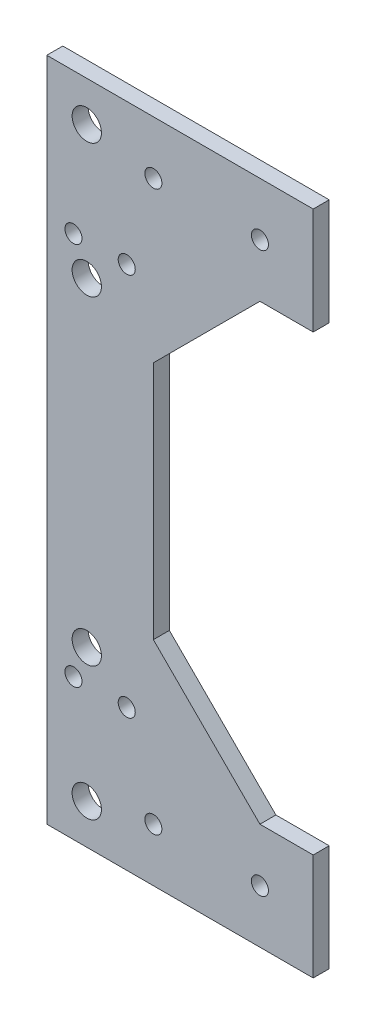
ISO-10303-21;
HEADER;
FILE_DESCRIPTION(('STEP AP214'),'2;1');
FILE_NAME('part.step','',(''),(''),'','','');
FILE_SCHEMA(('AUTOMOTIVE_DESIGN { 1 0 10303 214 1 1 1 1 }'));
ENDSEC;
DATA;
#1=APPLICATION_CONTEXT('core data for automotive mechanical design processes');
#2=APPLICATION_PROTOCOL_DEFINITION('international standard','automotive_design',2000,#1);
#3=PRODUCT_CONTEXT('',#1,'mechanical');
#4=PRODUCT('Part','Part','',(#3));
#5=PRODUCT_RELATED_PRODUCT_CATEGORY('part','',(#4));
#6=PRODUCT_DEFINITION_FORMATION('','',#4);
#7=PRODUCT_DEFINITION_CONTEXT('part definition',#1,'design');
#8=PRODUCT_DEFINITION('design','',#6,#7);
#9=PRODUCT_DEFINITION_SHAPE('','',#8);
#10=(LENGTH_UNIT() NAMED_UNIT(*) SI_UNIT(.MILLI.,.METRE.));
#11=(NAMED_UNIT(*) PLANE_ANGLE_UNIT() SI_UNIT($,.RADIAN.));
#12=(NAMED_UNIT(*) SI_UNIT($,.STERADIAN.) SOLID_ANGLE_UNIT());
#13=UNCERTAINTY_MEASURE_WITH_UNIT(LENGTH_MEASURE(1.E-05),#10,'distance_accuracy_value','');
#14=(GEOMETRIC_REPRESENTATION_CONTEXT(3) GLOBAL_UNCERTAINTY_ASSIGNED_CONTEXT((#13)) GLOBAL_UNIT_ASSIGNED_CONTEXT((#10,
#11,#12)) REPRESENTATION_CONTEXT('',''));
#15=CARTESIAN_POINT('',(0.,0.,0.));
#16=DIRECTION('',(0.,0.,1.));
#17=DIRECTION('',(1.,0.,0.));
#18=AXIS2_PLACEMENT_3D('',#15,#16,#17);
#19=CARTESIAN_POINT('',(0.,0.,3.));
#20=DIRECTION('',(0.,0.,1.));
#21=DIRECTION('',(1.,0.,0.));
#22=AXIS2_PLACEMENT_3D('',#19,#20,#21);
#23=PLANE('',#22);
#24=CARTESIAN_POINT('',(-87.4999999999999,55.,3.));
#25=DIRECTION('',(0.,0.,1.));
#26=DIRECTION('',(1.,0.,0.));
#27=AXIS2_PLACEMENT_3D('',#24,#25,#26);
#28=CIRCLE('',#27,2.75000000000001);
#29=CARTESIAN_POINT('',(-84.7499999999999,55.,3.));
#30=VERTEX_POINT('',#29);
#31=EDGE_CURVE('E490',#30,#30,#28,.T.);
#32=ORIENTED_EDGE('',*,*,#31,.F.);
#33=EDGE_LOOP('',(#32));
#34=FACE_BOUND('',#33,.T.);
#35=CARTESIAN_POINT('',(-87.5,30.,3.));
#36=DIRECTION('',(0.,0.,1.));
#37=DIRECTION('',(1.,0.,0.));
#38=AXIS2_PLACEMENT_3D('',#35,#36,#37);
#39=CIRCLE('',#38,2.75000000000001);
#40=CARTESIAN_POINT('',(-84.75,30.,3.));
#41=VERTEX_POINT('',#40);
#42=EDGE_CURVE('E511',#41,#41,#39,.T.);
#43=ORIENTED_EDGE('',*,*,#42,.F.);
#44=EDGE_LOOP('',(#43));
#45=FACE_BOUND('',#44,.T.);
#46=CARTESIAN_POINT('',(-87.4999999999999,-30.,3.));
#47=DIRECTION('',(0.,0.,1.));
#48=DIRECTION('',(1.,0.,0.));
#49=AXIS2_PLACEMENT_3D('',#46,#47,#48);
#50=CIRCLE('',#49,2.74999999999999);
#51=CARTESIAN_POINT('',(-84.75,-30.,3.));
#52=VERTEX_POINT('',#51);
#53=EDGE_CURVE('E498',#52,#52,#50,.T.);
#54=ORIENTED_EDGE('',*,*,#53,.F.);
#55=EDGE_LOOP('',(#54));
#56=FACE_BOUND('',#55,.T.);
#57=CARTESIAN_POINT('',(-87.5,-55.,3.));
#58=DIRECTION('',(0.,0.,1.));
#59=DIRECTION('',(1.,0.,0.));
#60=AXIS2_PLACEMENT_3D('',#57,#58,#59);
#61=CIRCLE('',#60,2.75000000000001);
#62=CARTESIAN_POINT('',(-84.75,-55.,3.));
#63=VERTEX_POINT('',#62);
#64=EDGE_CURVE('E494',#63,#63,#61,.T.);
#65=ORIENTED_EDGE('',*,*,#64,.F.);
#66=EDGE_LOOP('',(#65));
#67=FACE_BOUND('',#66,.T.);
#68=CARTESIAN_POINT('',(-90.0000000000001,36.0000000000002,3.));
#69=DIRECTION('',(0.,0.,1.));
#70=DIRECTION('',(1.,0.,0.));
#71=AXIS2_PLACEMENT_3D('',#68,#69,#70);
#72=CIRCLE('',#71,1.59999999999985);
#73=CARTESIAN_POINT('',(-88.4000000000003,36.0000000000002,3.));
#74=VERTEX_POINT('',#73);
#75=EDGE_CURVE('E519',#74,#74,#72,.T.);
#76=ORIENTED_EDGE('',*,*,#75,.F.);
#77=EDGE_LOOP('',(#76));
#78=FACE_BOUND('',#77,.T.);
#79=CARTESIAN_POINT('',(-79.9999999999998,-35.9999999999999,3.));
#80=DIRECTION('',(0.,0.,1.));
#81=DIRECTION('',(1.,0.,0.));
#82=AXIS2_PLACEMENT_3D('',#79,#80,#81);
#83=CIRCLE('',#82,1.59999999999985);
#84=CARTESIAN_POINT('',(-78.4,-35.9999999999999,3.));
#85=VERTEX_POINT('',#84);
#86=EDGE_CURVE('E518',#85,#85,#83,.T.);
#87=ORIENTED_EDGE('',*,*,#86,.F.);
#88=EDGE_LOOP('',(#87));
#89=FACE_BOUND('',#88,.T.);
#90=CARTESIAN_POINT('',(-90.0000000000001,-35.9999999999999,3.));
#91=DIRECTION('',(0.,0.,1.));
#92=DIRECTION('',(1.,0.,0.));
#93=AXIS2_PLACEMENT_3D('',#90,#91,#92);
#94=CIRCLE('',#93,1.59999999999985);
#95=CARTESIAN_POINT('',(-88.4000000000003,-35.9999999999999,3.));
#96=VERTEX_POINT('',#95);
#97=EDGE_CURVE('E515',#96,#96,#94,.T.);
#98=ORIENTED_EDGE('',*,*,#97,.F.);
#99=EDGE_LOOP('',(#98));
#100=FACE_BOUND('',#99,.T.);
#101=CARTESIAN_POINT('',(-79.9999999999999,36.0000000000002,3.));
#102=DIRECTION('',(0.,0.,1.));
#103=DIRECTION('',(1.,0.,0.));
#104=AXIS2_PLACEMENT_3D('',#101,#102,#103);
#105=CIRCLE('',#104,1.59999999999985);
#106=CARTESIAN_POINT('',(-78.4,36.0000000000002,3.));
#107=VERTEX_POINT('',#106);
#108=EDGE_CURVE('E190',#107,#107,#105,.T.);
#109=ORIENTED_EDGE('',*,*,#108,.F.);
#110=EDGE_LOOP('',(#109));
#111=FACE_BOUND('',#110,.T.);
#112=CARTESIAN_POINT('',(-54.9999999999996,52.5,3.));
#113=DIRECTION('',(0.,0.,1.));
#114=DIRECTION('',(1.,0.,0.));
#115=AXIS2_PLACEMENT_3D('',#112,#113,#114);
#116=CIRCLE('',#115,1.60000000000002);
#117=CARTESIAN_POINT('',(-53.3999999999996,52.5,3.));
#118=VERTEX_POINT('',#117);
#119=EDGE_CURVE('E210',#118,#118,#116,.T.);
#120=ORIENTED_EDGE('',*,*,#119,.F.);
#121=EDGE_LOOP('',(#120));
#122=FACE_BOUND('',#121,.T.);
#123=CARTESIAN_POINT('',(-54.9999999999996,-52.5,3.));
#124=DIRECTION('',(0.,0.,1.));
#125=DIRECTION('',(1.,0.,0.));
#126=AXIS2_PLACEMENT_3D('',#123,#124,#125);
#127=CIRCLE('',#126,1.60000000000002);
#128=CARTESIAN_POINT('',(-53.3999999999996,-52.5,3.));
#129=VERTEX_POINT('',#128);
#130=EDGE_CURVE('E154',#129,#129,#127,.T.);
#131=ORIENTED_EDGE('',*,*,#130,.F.);
#132=EDGE_LOOP('',(#131));
#133=FACE_BOUND('',#132,.T.);
#134=DIRECTION('',(-1.,0.,0.));
#135=VECTOR('',#134,1.);
#136=CARTESIAN_POINT('',(-55.,62.5,3.));
#137=LINE('',#136,#135);
#138=CARTESIAN_POINT('',(-45.,62.5,3.));
#139=VERTEX_POINT('',#138);
#140=CARTESIAN_POINT('',(-95.,62.5,3.));
#141=VERTEX_POINT('',#140);
#142=EDGE_CURVE('E54',#139,#141,#137,.T.);
#143=ORIENTED_EDGE('',*,*,#142,.T.);
#144=DIRECTION('',(0.,-1.,0.));
#145=VECTOR('',#144,1.);
#146=CARTESIAN_POINT('',(-95.,62.5,3.));
#147=LINE('',#146,#145);
#148=CARTESIAN_POINT('',(-95.,-62.5,3.));
#149=VERTEX_POINT('',#148);
#150=EDGE_CURVE('E104',#141,#149,#147,.T.);
#151=ORIENTED_EDGE('',*,*,#150,.T.);
#152=DIRECTION('',(1.,0.,0.));
#153=VECTOR('',#152,1.);
#154=CARTESIAN_POINT('',(-55.,-62.5,3.));
#155=LINE('',#154,#153);
#156=CARTESIAN_POINT('',(-45.,-62.5,3.));
#157=VERTEX_POINT('',#156);
#158=EDGE_CURVE('E228',#149,#157,#155,.T.);
#159=ORIENTED_EDGE('',*,*,#158,.T.);
#160=DIRECTION('',(0.,1.,0.));
#161=VECTOR('',#160,1.);
#162=CARTESIAN_POINT('',(-45.,-42.5,3.));
#163=LINE('',#162,#161);
#164=CARTESIAN_POINT('',(-45.,-42.5,3.));
#165=VERTEX_POINT('',#164);
#166=EDGE_CURVE('E230',#157,#165,#163,.T.);
#167=ORIENTED_EDGE('',*,*,#166,.T.);
#168=DIRECTION('',(-1.,0.,0.));
#169=VECTOR('',#168,1.);
#170=CARTESIAN_POINT('',(-55.,-42.5,3.));
#171=LINE('',#170,#169);
#172=CARTESIAN_POINT('',(-55.,-42.5,3.));
#173=VERTEX_POINT('',#172);
#174=EDGE_CURVE('E232',#165,#173,#171,.T.);
#175=ORIENTED_EDGE('',*,*,#174,.T.);
#176=DIRECTION('',(-0.707106781186548,0.707106781186547,0.));
#177=VECTOR('',#176,1.);
#178=CARTESIAN_POINT('',(-55.,-42.5,3.));
#179=LINE('',#178,#177);
#180=CARTESIAN_POINT('',(-75.,-22.5,3.));
#181=VERTEX_POINT('',#180);
#182=EDGE_CURVE('E234',#173,#181,#179,.T.);
#183=ORIENTED_EDGE('',*,*,#182,.T.);
#184=DIRECTION('',(0.,1.,0.));
#185=VECTOR('',#184,1.);
#186=CARTESIAN_POINT('',(-75.,-22.5,3.));
#187=LINE('',#186,#185);
#188=CARTESIAN_POINT('',(-75.,22.5,3.));
#189=VERTEX_POINT('',#188);
#190=EDGE_CURVE('E130',#181,#189,#187,.T.);
#191=ORIENTED_EDGE('',*,*,#190,.T.);
#192=DIRECTION('',(0.707106781186548,0.707106781186547,0.));
#193=VECTOR('',#192,1.);
#194=CARTESIAN_POINT('',(-75.,22.5,3.));
#195=LINE('',#194,#193);
#196=CARTESIAN_POINT('',(-55.,42.5,3.));
#197=VERTEX_POINT('',#196);
#198=EDGE_CURVE('E124',#189,#197,#195,.T.);
#199=ORIENTED_EDGE('',*,*,#198,.T.);
#200=DIRECTION('',(1.,0.,0.));
#201=VECTOR('',#200,1.);
#202=CARTESIAN_POINT('',(-55.,42.5,3.));
#203=LINE('',#202,#201);
#204=CARTESIAN_POINT('',(-45.,42.5,3.));
#205=VERTEX_POINT('',#204);
#206=EDGE_CURVE('E128',#197,#205,#203,.T.);
#207=ORIENTED_EDGE('',*,*,#206,.T.);
#208=DIRECTION('',(0.,1.,0.));
#209=VECTOR('',#208,1.);
#210=CARTESIAN_POINT('',(-45.,62.5,3.));
#211=LINE('',#210,#209);
#212=EDGE_CURVE('E144',#205,#139,#211,.T.);
#213=ORIENTED_EDGE('',*,*,#212,.T.);
#214=EDGE_LOOP('',(#143,#151,#159,#167,#175,#183,#191,#199,#207,#213));
#215=FACE_BOUND('',#214,.T.);
#216=CARTESIAN_POINT('',(-74.9999999999996,-52.5,3.));
#217=DIRECTION('',(0.,0.,1.));
#218=DIRECTION('',(1.,0.,0.));
#219=AXIS2_PLACEMENT_3D('',#216,#217,#218);
#220=CIRCLE('',#219,1.60000000000002);
#221=CARTESIAN_POINT('',(-73.3999999999996,-52.5,3.));
#222=VERTEX_POINT('',#221);
#223=EDGE_CURVE('E216',#222,#222,#220,.T.);
#224=ORIENTED_EDGE('',*,*,#223,.F.);
#225=EDGE_LOOP('',(#224));
#226=FACE_BOUND('',#225,.T.);
#227=CARTESIAN_POINT('',(-74.9999999999996,52.5,3.));
#228=DIRECTION('',(0.,0.,1.));
#229=DIRECTION('',(1.,0.,0.));
#230=AXIS2_PLACEMENT_3D('',#227,#228,#229);
#231=CIRCLE('',#230,1.60000000000002);
#232=CARTESIAN_POINT('',(-73.3999999999996,52.5,3.));
#233=VERTEX_POINT('',#232);
#234=EDGE_CURVE('E201',#233,#233,#231,.T.);
#235=ORIENTED_EDGE('',*,*,#234,.F.);
#236=EDGE_LOOP('',(#235));
#237=FACE_BOUND('',#236,.T.);
#238=ADVANCED_FACE('F35',(#34,#45,#56,#67,#78,#89,#100,#111,#122,#133,#215,#226,#237),#23,.T.);
#239=CARTESIAN_POINT('',(0.,0.,0.));
#240=DIRECTION('',(0.,0.,1.));
#241=DIRECTION('',(1.,0.,0.));
#242=AXIS2_PLACEMENT_3D('',#239,#240,#241);
#243=PLANE('',#242);
#244=CARTESIAN_POINT('',(-87.4999999999999,55.,0.));
#245=DIRECTION('',(0.,0.,-1.));
#246=DIRECTION('',(-1.,0.,0.));
#247=AXIS2_PLACEMENT_3D('',#244,#245,#246);
#248=CIRCLE('',#247,2.75000000000001);
#249=CARTESIAN_POINT('',(-90.2499999999999,55.,0.));
#250=VERTEX_POINT('',#249);
#251=EDGE_CURVE('E493',#250,#250,#248,.T.);
#252=ORIENTED_EDGE('',*,*,#251,.F.);
#253=EDGE_LOOP('',(#252));
#254=FACE_BOUND('',#253,.T.);
#255=CARTESIAN_POINT('',(-87.5,30.,0.));
#256=DIRECTION('',(0.,0.,-1.));
#257=DIRECTION('',(-1.,0.,0.));
#258=AXIS2_PLACEMENT_3D('',#255,#256,#257);
#259=CIRCLE('',#258,2.75000000000001);
#260=CARTESIAN_POINT('',(-90.25,30.,0.));
#261=VERTEX_POINT('',#260);
#262=EDGE_CURVE('E495',#261,#261,#259,.T.);
#263=ORIENTED_EDGE('',*,*,#262,.F.);
#264=EDGE_LOOP('',(#263));
#265=FACE_BOUND('',#264,.T.);
#266=CARTESIAN_POINT('',(-87.4999999999999,-30.,0.));
#267=DIRECTION('',(0.,0.,-1.));
#268=DIRECTION('',(-1.,0.,0.));
#269=AXIS2_PLACEMENT_3D('',#266,#267,#268);
#270=CIRCLE('',#269,2.74999999999999);
#271=CARTESIAN_POINT('',(-90.2499999999999,-30.,0.));
#272=VERTEX_POINT('',#271);
#273=EDGE_CURVE('E501',#272,#272,#270,.T.);
#274=ORIENTED_EDGE('',*,*,#273,.F.);
#275=EDGE_LOOP('',(#274));
#276=FACE_BOUND('',#275,.T.);
#277=CARTESIAN_POINT('',(-87.5,-55.,0.));
#278=DIRECTION('',(0.,0.,-1.));
#279=DIRECTION('',(-1.,0.,0.));
#280=AXIS2_PLACEMENT_3D('',#277,#278,#279);
#281=CIRCLE('',#280,2.75000000000001);
#282=CARTESIAN_POINT('',(-90.25,-55.,0.));
#283=VERTEX_POINT('',#282);
#284=EDGE_CURVE('E506',#283,#283,#281,.T.);
#285=ORIENTED_EDGE('',*,*,#284,.F.);
#286=EDGE_LOOP('',(#285));
#287=FACE_BOUND('',#286,.T.);
#288=CARTESIAN_POINT('',(-90.0000000000001,36.0000000000002,0.));
#289=DIRECTION('',(0.,0.,1.));
#290=DIRECTION('',(1.,0.,0.));
#291=AXIS2_PLACEMENT_3D('',#288,#289,#290);
#292=CIRCLE('',#291,1.59999999999985);
#293=CARTESIAN_POINT('',(-88.4000000000003,36.0000000000002,0.));
#294=VERTEX_POINT('',#293);
#295=EDGE_CURVE('E39',#294,#294,#292,.T.);
#296=ORIENTED_EDGE('',*,*,#295,.T.);
#297=EDGE_LOOP('',(#296));
#298=FACE_BOUND('',#297,.T.);
#299=CARTESIAN_POINT('',(-79.9999999999998,-35.9999999999999,0.));
#300=DIRECTION('',(0.,0.,1.));
#301=DIRECTION('',(1.,0.,0.));
#302=AXIS2_PLACEMENT_3D('',#299,#300,#301);
#303=CIRCLE('',#302,1.59999999999985);
#304=CARTESIAN_POINT('',(-78.4,-35.9999999999999,0.));
#305=VERTEX_POINT('',#304);
#306=EDGE_CURVE('E192',#305,#305,#303,.T.);
#307=ORIENTED_EDGE('',*,*,#306,.T.);
#308=EDGE_LOOP('',(#307));
#309=FACE_BOUND('',#308,.T.);
#310=CARTESIAN_POINT('',(-90.0000000000001,-35.9999999999999,0.));
#311=DIRECTION('',(0.,0.,1.));
#312=DIRECTION('',(1.,0.,0.));
#313=AXIS2_PLACEMENT_3D('',#310,#311,#312);
#314=CIRCLE('',#313,1.59999999999985);
#315=CARTESIAN_POINT('',(-88.4000000000003,-35.9999999999999,0.));
#316=VERTEX_POINT('',#315);
#317=EDGE_CURVE('E189',#316,#316,#314,.T.);
#318=ORIENTED_EDGE('',*,*,#317,.T.);
#319=EDGE_LOOP('',(#318));
#320=FACE_BOUND('',#319,.T.);
#321=CARTESIAN_POINT('',(-79.9999999999999,36.0000000000002,0.));
#322=DIRECTION('',(0.,0.,1.));
#323=DIRECTION('',(1.,0.,0.));
#324=AXIS2_PLACEMENT_3D('',#321,#322,#323);
#325=CIRCLE('',#324,1.59999999999985);
#326=CARTESIAN_POINT('',(-78.4,36.0000000000002,0.));
#327=VERTEX_POINT('',#326);
#328=EDGE_CURVE('E186',#327,#327,#325,.T.);
#329=ORIENTED_EDGE('',*,*,#328,.T.);
#330=EDGE_LOOP('',(#329));
#331=FACE_BOUND('',#330,.T.);
#332=DIRECTION('',(0.,-1.,0.));
#333=VECTOR('',#332,1.);
#334=CARTESIAN_POINT('',(-95.,62.5,0.));
#335=LINE('',#334,#333);
#336=CARTESIAN_POINT('',(-95.,62.5,0.));
#337=VERTEX_POINT('',#336);
#338=CARTESIAN_POINT('',(-95.,-62.5,0.));
#339=VERTEX_POINT('',#338);
#340=EDGE_CURVE('E150',#337,#339,#335,.T.);
#341=ORIENTED_EDGE('',*,*,#340,.F.);
#342=DIRECTION('',(-1.,0.,0.));
#343=VECTOR('',#342,1.);
#344=CARTESIAN_POINT('',(-55.,62.5,0.));
#345=LINE('',#344,#343);
#346=CARTESIAN_POINT('',(-45.,62.5,0.));
#347=VERTEX_POINT('',#346);
#348=EDGE_CURVE('E167',#347,#337,#345,.T.);
#349=ORIENTED_EDGE('',*,*,#348,.F.);
#350=DIRECTION('',(0.,1.,0.));
#351=VECTOR('',#350,1.);
#352=CARTESIAN_POINT('',(-45.,62.5,0.));
#353=LINE('',#352,#351);
#354=CARTESIAN_POINT('',(-45.,42.5,0.));
#355=VERTEX_POINT('',#354);
#356=EDGE_CURVE('E97',#355,#347,#353,.T.);
#357=ORIENTED_EDGE('',*,*,#356,.F.);
#358=DIRECTION('',(1.,0.,0.));
#359=VECTOR('',#358,1.);
#360=CARTESIAN_POINT('',(-55.,42.5,0.));
#361=LINE('',#360,#359);
#362=CARTESIAN_POINT('',(-55.,42.5,0.));
#363=VERTEX_POINT('',#362);
#364=EDGE_CURVE('E90',#363,#355,#361,.T.);
#365=ORIENTED_EDGE('',*,*,#364,.F.);
#366=DIRECTION('',(0.707106781186548,0.707106781186547,0.));
#367=VECTOR('',#366,1.);
#368=CARTESIAN_POINT('',(-75.,22.5,0.));
#369=LINE('',#368,#367);
#370=CARTESIAN_POINT('',(-75.,22.5,0.));
#371=VERTEX_POINT('',#370);
#372=EDGE_CURVE('E138',#371,#363,#369,.T.);
#373=ORIENTED_EDGE('',*,*,#372,.F.);
#374=DIRECTION('',(0.,1.,0.));
#375=VECTOR('',#374,1.);
#376=CARTESIAN_POINT('',(-75.,-22.5,0.));
#377=LINE('',#376,#375);
#378=CARTESIAN_POINT('',(-75.,-22.5,0.));
#379=VERTEX_POINT('',#378);
#380=EDGE_CURVE('E162',#379,#371,#377,.T.);
#381=ORIENTED_EDGE('',*,*,#380,.F.);
#382=DIRECTION('',(-0.707106781186548,0.707106781186547,0.));
#383=VECTOR('',#382,1.);
#384=CARTESIAN_POINT('',(-55.,-42.5,0.));
#385=LINE('',#384,#383);
#386=CARTESIAN_POINT('',(-55.,-42.5,0.));
#387=VERTEX_POINT('',#386);
#388=EDGE_CURVE('E160',#387,#379,#385,.T.);
#389=ORIENTED_EDGE('',*,*,#388,.F.);
#390=DIRECTION('',(-1.,0.,0.));
#391=VECTOR('',#390,1.);
#392=CARTESIAN_POINT('',(-55.,-42.5,0.));
#393=LINE('',#392,#391);
#394=CARTESIAN_POINT('',(-45.,-42.5,0.));
#395=VERTEX_POINT('',#394);
#396=EDGE_CURVE('E158',#395,#387,#393,.T.);
#397=ORIENTED_EDGE('',*,*,#396,.F.);
#398=DIRECTION('',(0.,1.,0.));
#399=VECTOR('',#398,1.);
#400=CARTESIAN_POINT('',(-45.,-42.5,0.));
#401=LINE('',#400,#399);
#402=CARTESIAN_POINT('',(-45.,-62.5,0.));
#403=VERTEX_POINT('',#402);
#404=EDGE_CURVE('E156',#403,#395,#401,.T.);
#405=ORIENTED_EDGE('',*,*,#404,.F.);
#406=DIRECTION('',(1.,0.,0.));
#407=VECTOR('',#406,1.);
#408=CARTESIAN_POINT('',(-55.,-62.5,0.));
#409=LINE('',#408,#407);
#410=EDGE_CURVE('E153',#339,#403,#409,.T.);
#411=ORIENTED_EDGE('',*,*,#410,.F.);
#412=EDGE_LOOP('',(#341,#349,#357,#365,#373,#381,#389,#397,#405,#411));
#413=FACE_BOUND('',#412,.T.);
#414=CARTESIAN_POINT('',(-54.9999999999996,-52.5,0.));
#415=DIRECTION('',(0.,0.,1.));
#416=DIRECTION('',(1.,0.,0.));
#417=AXIS2_PLACEMENT_3D('',#414,#415,#416);
#418=CIRCLE('',#417,1.60000000000002);
#419=CARTESIAN_POINT('',(-53.3999999999996,-52.5,0.));
#420=VERTEX_POINT('',#419);
#421=EDGE_CURVE('E219',#420,#420,#418,.T.);
#422=ORIENTED_EDGE('',*,*,#421,.T.);
#423=EDGE_LOOP('',(#422));
#424=FACE_BOUND('',#423,.T.);
#425=CARTESIAN_POINT('',(-74.9999999999996,-52.5,0.));
#426=DIRECTION('',(0.,0.,1.));
#427=DIRECTION('',(1.,0.,0.));
#428=AXIS2_PLACEMENT_3D('',#425,#426,#427);
#429=CIRCLE('',#428,1.60000000000002);
#430=CARTESIAN_POINT('',(-73.3999999999996,-52.5,0.));
#431=VERTEX_POINT('',#430);
#432=EDGE_CURVE('E213',#431,#431,#429,.T.);
#433=ORIENTED_EDGE('',*,*,#432,.T.);
#434=EDGE_LOOP('',(#433));
#435=FACE_BOUND('',#434,.T.);
#436=CARTESIAN_POINT('',(-54.9999999999996,52.5,0.));
#437=DIRECTION('',(0.,0.,1.));
#438=DIRECTION('',(1.,0.,0.));
#439=AXIS2_PLACEMENT_3D('',#436,#437,#438);
#440=CIRCLE('',#439,1.60000000000002);
#441=CARTESIAN_POINT('',(-53.3999999999996,52.5,0.));
#442=VERTEX_POINT('',#441);
#443=EDGE_CURVE('E206',#442,#442,#440,.T.);
#444=ORIENTED_EDGE('',*,*,#443,.T.);
#445=EDGE_LOOP('',(#444));
#446=FACE_BOUND('',#445,.T.);
#447=CARTESIAN_POINT('',(-74.9999999999996,52.5,0.));
#448=DIRECTION('',(0.,0.,1.));
#449=DIRECTION('',(1.,0.,0.));
#450=AXIS2_PLACEMENT_3D('',#447,#448,#449);
#451=CIRCLE('',#450,1.60000000000002);
#452=CARTESIAN_POINT('',(-73.3999999999996,52.5,0.));
#453=VERTEX_POINT('',#452);
#454=EDGE_CURVE('E197',#453,#453,#451,.T.);
#455=ORIENTED_EDGE('',*,*,#454,.T.);
#456=EDGE_LOOP('',(#455));
#457=FACE_BOUND('',#456,.T.);
#458=ADVANCED_FACE('F247',(#254,#265,#276,#287,#298,#309,#320,#331,#413,#424,#435,#446,#457),
#243,.F.);
#459=CARTESIAN_POINT('',(-95.,62.5,3.));
#460=DIRECTION('',(1.,0.,0.));
#461=DIRECTION('',(0.,1.,0.));
#462=AXIS2_PLACEMENT_3D('',#459,#460,#461);
#463=PLANE('',#462);
#464=ORIENTED_EDGE('',*,*,#340,.T.);
#465=DIRECTION('',(0.,0.,-1.));
#466=VECTOR('',#465,1.);
#467=CARTESIAN_POINT('',(-95.,-62.5,3.));
#468=LINE('',#467,#466);
#469=EDGE_CURVE('E45',#149,#339,#468,.T.);
#470=ORIENTED_EDGE('',*,*,#469,.F.);
#471=ORIENTED_EDGE('',*,*,#150,.F.);
#472=DIRECTION('',(0.,0.,-1.));
#473=VECTOR('',#472,1.);
#474=CARTESIAN_POINT('',(-95.,62.5,3.));
#475=LINE('',#474,#473);
#476=EDGE_CURVE('E11',#141,#337,#475,.T.);
#477=ORIENTED_EDGE('',*,*,#476,.T.);
#478=EDGE_LOOP('',(#464,#470,#471,#477));
#479=FACE_BOUND('',#478,.T.);
#480=ADVANCED_FACE('F37',(#479),#463,.F.);
#481=CARTESIAN_POINT('',(-55.,-62.5,3.));
#482=DIRECTION('',(0.,1.,0.));
#483=DIRECTION('',(-1.,0.,0.));
#484=AXIS2_PLACEMENT_3D('',#481,#482,#483);
#485=PLANE('',#484);
#486=ORIENTED_EDGE('',*,*,#410,.T.);
#487=DIRECTION('',(0.,0.,-1.));
#488=VECTOR('',#487,1.);
#489=CARTESIAN_POINT('',(-45.,-62.5,3.));
#490=LINE('',#489,#488);
#491=EDGE_CURVE('E181',#157,#403,#490,.T.);
#492=ORIENTED_EDGE('',*,*,#491,.F.);
#493=ORIENTED_EDGE('',*,*,#158,.F.);
#494=ORIENTED_EDGE('',*,*,#469,.T.);
#495=EDGE_LOOP('',(#486,#492,#493,#494));
#496=FACE_BOUND('',#495,.T.);
#497=ADVANCED_FACE('F255',(#496),#485,.F.);
#498=CARTESIAN_POINT('',(-45.,-42.5,3.));
#499=DIRECTION('',(-1.,0.,0.));
#500=DIRECTION('',(0.,-1.,0.));
#501=AXIS2_PLACEMENT_3D('',#498,#499,#500);
#502=PLANE('',#501);
#503=ORIENTED_EDGE('',*,*,#404,.T.);
#504=DIRECTION('',(0.,0.,-1.));
#505=VECTOR('',#504,1.);
#506=CARTESIAN_POINT('',(-45.,-42.5,3.));
#507=LINE('',#506,#505);
#508=EDGE_CURVE('E178',#165,#395,#507,.T.);
#509=ORIENTED_EDGE('',*,*,#508,.F.);
#510=ORIENTED_EDGE('',*,*,#166,.F.);
#511=ORIENTED_EDGE('',*,*,#491,.T.);
#512=EDGE_LOOP('',(#503,#509,#510,#511));
#513=FACE_BOUND('',#512,.T.);
#514=ADVANCED_FACE('F260',(#513),#502,.F.);
#515=CARTESIAN_POINT('',(-55.,-42.5,3.));
#516=DIRECTION('',(0.,-1.,0.));
#517=DIRECTION('',(0.,0.,-1.));
#518=AXIS2_PLACEMENT_3D('',#515,#516,#517);
#519=PLANE('',#518);
#520=ORIENTED_EDGE('',*,*,#396,.T.);
#521=DIRECTION('',(0.,0.,-1.));
#522=VECTOR('',#521,1.);
#523=CARTESIAN_POINT('',(-55.,-42.5,3.));
#524=LINE('',#523,#522);
#525=EDGE_CURVE('E175',#173,#387,#524,.T.);
#526=ORIENTED_EDGE('',*,*,#525,.F.);
#527=ORIENTED_EDGE('',*,*,#174,.F.);
#528=ORIENTED_EDGE('',*,*,#508,.T.);
#529=EDGE_LOOP('',(#520,#526,#527,#528));
#530=FACE_BOUND('',#529,.T.);
#531=ADVANCED_FACE('F263',(#530),#519,.F.);
#532=CARTESIAN_POINT('',(-55.,-42.5,3.));
#533=DIRECTION('',(-0.707106781186547,-0.707106781186548,0.));
#534=DIRECTION('',(0.707106781186548,-0.707106781186547,0.));
#535=AXIS2_PLACEMENT_3D('',#532,#533,#534);
#536=PLANE('',#535);
#537=ORIENTED_EDGE('',*,*,#388,.T.);
#538=DIRECTION('',(0.,0.,-1.));
#539=VECTOR('',#538,1.);
#540=CARTESIAN_POINT('',(-75.,-22.5,3.));
#541=LINE('',#540,#539);
#542=EDGE_CURVE('E172',#181,#379,#541,.T.);
#543=ORIENTED_EDGE('',*,*,#542,.F.);
#544=ORIENTED_EDGE('',*,*,#182,.F.);
#545=ORIENTED_EDGE('',*,*,#525,.T.);
#546=EDGE_LOOP('',(#537,#543,#544,#545));
#547=FACE_BOUND('',#546,.T.);
#548=ADVANCED_FACE('F240',(#547),#536,.F.);
#549=CARTESIAN_POINT('',(-75.,-22.5,3.));
#550=DIRECTION('',(-1.,0.,0.));
#551=DIRECTION('',(0.,0.,1.));
#552=AXIS2_PLACEMENT_3D('',#549,#550,#551);
#553=PLANE('',#552);
#554=ORIENTED_EDGE('',*,*,#380,.T.);
#555=DIRECTION('',(0.,0.,-1.));
#556=VECTOR('',#555,1.);
#557=CARTESIAN_POINT('',(-75.,22.5,3.));
#558=LINE('',#557,#556);
#559=EDGE_CURVE('E139',#189,#371,#558,.T.);
#560=ORIENTED_EDGE('',*,*,#559,.F.);
#561=ORIENTED_EDGE('',*,*,#190,.F.);
#562=ORIENTED_EDGE('',*,*,#542,.T.);
#563=EDGE_LOOP('',(#554,#560,#561,#562));
#564=FACE_BOUND('',#563,.T.);
#565=ADVANCED_FACE('F244',(#564),#553,.F.);
#566=CARTESIAN_POINT('',(-75.,22.5,3.));
#567=DIRECTION('',(-0.707106781186547,0.707106781186548,0.));
#568=DIRECTION('',(-0.707106781186548,-0.707106781186547,0.));
#569=AXIS2_PLACEMENT_3D('',#566,#567,#568);
#570=PLANE('',#569);
#571=ORIENTED_EDGE('',*,*,#372,.T.);
#572=DIRECTION('',(0.,0.,-1.));
#573=VECTOR('',#572,1.);
#574=CARTESIAN_POINT('',(-55.,42.5,3.));
#575=LINE('',#574,#573);
#576=EDGE_CURVE('E135',#197,#363,#575,.T.);
#577=ORIENTED_EDGE('',*,*,#576,.F.);
#578=ORIENTED_EDGE('',*,*,#198,.F.);
#579=ORIENTED_EDGE('',*,*,#559,.T.);
#580=EDGE_LOOP('',(#571,#577,#578,#579));
#581=FACE_BOUND('',#580,.T.);
#582=ADVANCED_FACE('F136',(#581),#570,.F.);
#583=CARTESIAN_POINT('',(-55.,42.5,3.));
#584=DIRECTION('',(0.,1.,0.));
#585=DIRECTION('',(0.,0.,1.));
#586=AXIS2_PLACEMENT_3D('',#583,#584,#585);
#587=PLANE('',#586);
#588=ORIENTED_EDGE('',*,*,#364,.T.);
#589=DIRECTION('',(0.,0.,-1.));
#590=VECTOR('',#589,1.);
#591=CARTESIAN_POINT('',(-45.,42.5,3.));
#592=LINE('',#591,#590);
#593=EDGE_CURVE('E140',#205,#355,#592,.T.);
#594=ORIENTED_EDGE('',*,*,#593,.F.);
#595=ORIENTED_EDGE('',*,*,#206,.F.);
#596=ORIENTED_EDGE('',*,*,#576,.T.);
#597=EDGE_LOOP('',(#588,#594,#595,#596));
#598=FACE_BOUND('',#597,.T.);
#599=ADVANCED_FACE('F142',(#598),#587,.F.);
#600=CARTESIAN_POINT('',(-45.,62.5,3.));
#601=DIRECTION('',(-1.,0.,0.));
#602=DIRECTION('',(0.,0.,1.));
#603=AXIS2_PLACEMENT_3D('',#600,#601,#602);
#604=PLANE('',#603);
#605=ORIENTED_EDGE('',*,*,#356,.T.);
#606=DIRECTION('',(0.,0.,-1.));
#607=VECTOR('',#606,1.);
#608=CARTESIAN_POINT('',(-45.,62.5,3.));
#609=LINE('',#608,#607);
#610=EDGE_CURVE('E146',#139,#347,#609,.T.);
#611=ORIENTED_EDGE('',*,*,#610,.F.);
#612=ORIENTED_EDGE('',*,*,#212,.F.);
#613=ORIENTED_EDGE('',*,*,#593,.T.);
#614=EDGE_LOOP('',(#605,#611,#612,#613));
#615=FACE_BOUND('',#614,.T.);
#616=ADVANCED_FACE('F251',(#615),#604,.F.);
#617=CARTESIAN_POINT('',(-55.,62.5,3.));
#618=DIRECTION('',(0.,-1.,0.));
#619=DIRECTION('',(0.,0.,-1.));
#620=AXIS2_PLACEMENT_3D('',#617,#618,#619);
#621=PLANE('',#620);
#622=ORIENTED_EDGE('',*,*,#348,.T.);
#623=ORIENTED_EDGE('',*,*,#476,.F.);
#624=ORIENTED_EDGE('',*,*,#142,.F.);
#625=ORIENTED_EDGE('',*,*,#610,.T.);
#626=EDGE_LOOP('',(#622,#623,#624,#625));
#627=FACE_BOUND('',#626,.T.);
#628=ADVANCED_FACE('F250',(#627),#621,.F.);
#629=CARTESIAN_POINT('',(-54.9999999999996,-52.5,3.));
#630=DIRECTION('',(0.,0.,-1.));
#631=DIRECTION('',(-1.,0.,0.));
#632=AXIS2_PLACEMENT_3D('',#629,#630,#631);
#633=CYLINDRICAL_SURFACE('',#632,1.60000000000002);
#634=ORIENTED_EDGE('',*,*,#130,.T.);
#635=EDGE_LOOP('',(#634));
#636=FACE_BOUND('',#635,.T.);
#637=ORIENTED_EDGE('',*,*,#421,.F.);
#638=EDGE_LOOP('',(#637));
#639=FACE_BOUND('',#638,.T.);
#640=ADVANCED_FACE('F283',(#636,#639),#633,.F.);
#641=CARTESIAN_POINT('',(-74.9999999999996,-52.5,3.));
#642=DIRECTION('',(0.,0.,-1.));
#643=DIRECTION('',(-1.,0.,0.));
#644=AXIS2_PLACEMENT_3D('',#641,#642,#643);
#645=CYLINDRICAL_SURFACE('',#644,1.60000000000002);
#646=ORIENTED_EDGE('',*,*,#223,.T.);
#647=EDGE_LOOP('',(#646));
#648=FACE_BOUND('',#647,.T.);
#649=ORIENTED_EDGE('',*,*,#432,.F.);
#650=EDGE_LOOP('',(#649));
#651=FACE_BOUND('',#650,.T.);
#652=ADVANCED_FACE('F321',(#648,#651),#645,.F.);
#653=CARTESIAN_POINT('',(-54.9999999999996,52.5,3.));
#654=DIRECTION('',(0.,0.,-1.));
#655=DIRECTION('',(-1.,0.,0.));
#656=AXIS2_PLACEMENT_3D('',#653,#654,#655);
#657=CYLINDRICAL_SURFACE('',#656,1.60000000000002);
#658=ORIENTED_EDGE('',*,*,#119,.T.);
#659=EDGE_LOOP('',(#658));
#660=FACE_BOUND('',#659,.T.);
#661=ORIENTED_EDGE('',*,*,#443,.F.);
#662=EDGE_LOOP('',(#661));
#663=FACE_BOUND('',#662,.T.);
#664=ADVANCED_FACE('F328',(#660,#663),#657,.F.);
#665=CARTESIAN_POINT('',(-74.9999999999996,52.5,3.));
#666=DIRECTION('',(0.,0.,-1.));
#667=DIRECTION('',(-1.,0.,0.));
#668=AXIS2_PLACEMENT_3D('',#665,#666,#667);
#669=CYLINDRICAL_SURFACE('',#668,1.60000000000002);
#670=ORIENTED_EDGE('',*,*,#234,.T.);
#671=EDGE_LOOP('',(#670));
#672=FACE_BOUND('',#671,.T.);
#673=ORIENTED_EDGE('',*,*,#454,.F.);
#674=EDGE_LOOP('',(#673));
#675=FACE_BOUND('',#674,.T.);
#676=ADVANCED_FACE('F335',(#672,#675),#669,.F.);
#677=CARTESIAN_POINT('',(-79.9999999999999,36.0000000000002,-23.));
#678=DIRECTION('',(0.,0.,1.));
#679=DIRECTION('',(1.,0.,0.));
#680=AXIS2_PLACEMENT_3D('',#677,#678,#679);
#681=CYLINDRICAL_SURFACE('',#680,1.59999999999985);
#682=ORIENTED_EDGE('',*,*,#108,.T.);
#683=EDGE_LOOP('',(#682));
#684=FACE_BOUND('',#683,.T.);
#685=ORIENTED_EDGE('',*,*,#328,.F.);
#686=EDGE_LOOP('',(#685));
#687=FACE_BOUND('',#686,.T.);
#688=ADVANCED_FACE('F343',(#684,#687),#681,.F.);
#689=CARTESIAN_POINT('',(-90.0000000000001,-35.9999999999999,-23.));
#690=DIRECTION('',(0.,0.,1.));
#691=DIRECTION('',(1.,0.,0.));
#692=AXIS2_PLACEMENT_3D('',#689,#690,#691);
#693=CYLINDRICAL_SURFACE('',#692,1.59999999999985);
#694=ORIENTED_EDGE('',*,*,#97,.T.);
#695=EDGE_LOOP('',(#694));
#696=FACE_BOUND('',#695,.T.);
#697=ORIENTED_EDGE('',*,*,#317,.F.);
#698=EDGE_LOOP('',(#697));
#699=FACE_BOUND('',#698,.T.);
#700=ADVANCED_FACE('F351',(#696,#699),#693,.F.);
#701=CARTESIAN_POINT('',(-79.9999999999998,-35.9999999999999,-23.));
#702=DIRECTION('',(0.,0.,1.));
#703=DIRECTION('',(1.,0.,0.));
#704=AXIS2_PLACEMENT_3D('',#701,#702,#703);
#705=CYLINDRICAL_SURFACE('',#704,1.59999999999985);
#706=ORIENTED_EDGE('',*,*,#86,.T.);
#707=EDGE_LOOP('',(#706));
#708=FACE_BOUND('',#707,.T.);
#709=ORIENTED_EDGE('',*,*,#306,.F.);
#710=EDGE_LOOP('',(#709));
#711=FACE_BOUND('',#710,.T.);
#712=ADVANCED_FACE('F359',(#708,#711),#705,.F.);
#713=CARTESIAN_POINT('',(-90.0000000000001,36.0000000000002,-23.));
#714=DIRECTION('',(0.,0.,1.));
#715=DIRECTION('',(1.,0.,0.));
#716=AXIS2_PLACEMENT_3D('',#713,#714,#715);
#717=CYLINDRICAL_SURFACE('',#716,1.59999999999985);
#718=ORIENTED_EDGE('',*,*,#75,.T.);
#719=EDGE_LOOP('',(#718));
#720=FACE_BOUND('',#719,.T.);
#721=ORIENTED_EDGE('',*,*,#295,.F.);
#722=EDGE_LOOP('',(#721));
#723=FACE_BOUND('',#722,.T.);
#724=ADVANCED_FACE('F367',(#720,#723),#717,.F.);
#725=CARTESIAN_POINT('',(-87.5,-55.,10.));
#726=DIRECTION('',(0.,0.,-1.));
#727=DIRECTION('',(-1.,0.,0.));
#728=AXIS2_PLACEMENT_3D('',#725,#726,#727);
#729=CYLINDRICAL_SURFACE('',#728,2.75000000000001);
#730=ORIENTED_EDGE('',*,*,#64,.T.);
#731=EDGE_LOOP('',(#730));
#732=FACE_BOUND('',#731,.T.);
#733=ORIENTED_EDGE('',*,*,#284,.T.);
#734=EDGE_LOOP('',(#733));
#735=FACE_BOUND('',#734,.T.);
#736=ADVANCED_FACE('F375',(#732,#735),#729,.F.);
#737=CARTESIAN_POINT('',(-87.4999999999999,-30.,10.));
#738=DIRECTION('',(0.,0.,-1.));
#739=DIRECTION('',(-1.,0.,0.));
#740=AXIS2_PLACEMENT_3D('',#737,#738,#739);
#741=CYLINDRICAL_SURFACE('',#740,2.74999999999999);
#742=ORIENTED_EDGE('',*,*,#53,.T.);
#743=EDGE_LOOP('',(#742));
#744=FACE_BOUND('',#743,.T.);
#745=ORIENTED_EDGE('',*,*,#273,.T.);
#746=EDGE_LOOP('',(#745));
#747=FACE_BOUND('',#746,.T.);
#748=ADVANCED_FACE('F383',(#744,#747),#741,.F.);
#749=CARTESIAN_POINT('',(-87.5,30.,10.));
#750=DIRECTION('',(0.,0.,-1.));
#751=DIRECTION('',(-1.,0.,0.));
#752=AXIS2_PLACEMENT_3D('',#749,#750,#751);
#753=CYLINDRICAL_SURFACE('',#752,2.75000000000001);
#754=ORIENTED_EDGE('',*,*,#42,.T.);
#755=EDGE_LOOP('',(#754));
#756=FACE_BOUND('',#755,.T.);
#757=ORIENTED_EDGE('',*,*,#262,.T.);
#758=EDGE_LOOP('',(#757));
#759=FACE_BOUND('',#758,.T.);
#760=ADVANCED_FACE('F392',(#756,#759),#753,.F.);
#761=CARTESIAN_POINT('',(-87.4999999999999,55.,10.));
#762=DIRECTION('',(0.,0.,-1.));
#763=DIRECTION('',(-1.,0.,0.));
#764=AXIS2_PLACEMENT_3D('',#761,#762,#763);
#765=CYLINDRICAL_SURFACE('',#764,2.75000000000001);
#766=ORIENTED_EDGE('',*,*,#31,.T.);
#767=EDGE_LOOP('',(#766));
#768=FACE_BOUND('',#767,.T.);
#769=ORIENTED_EDGE('',*,*,#251,.T.);
#770=EDGE_LOOP('',(#769));
#771=FACE_BOUND('',#770,.T.);
#772=ADVANCED_FACE('F400',(#768,#771),#765,.F.);
#773=CLOSED_SHELL('',(#238,#458,#480,#497,#514,#531,#548,#565,#582,#599,#616,#628,#640,#652,
#664,#676,#688,#700,#712,#724,#736,#748,#760,#772));
#774=MANIFOLD_SOLID_BREP('B2',#773);
#775=ADVANCED_BREP_SHAPE_REPRESENTATION('',(#18,#774),#14);
#776=SHAPE_DEFINITION_REPRESENTATION(#9,#775);
ENDSEC;
END-ISO-10303-21;
